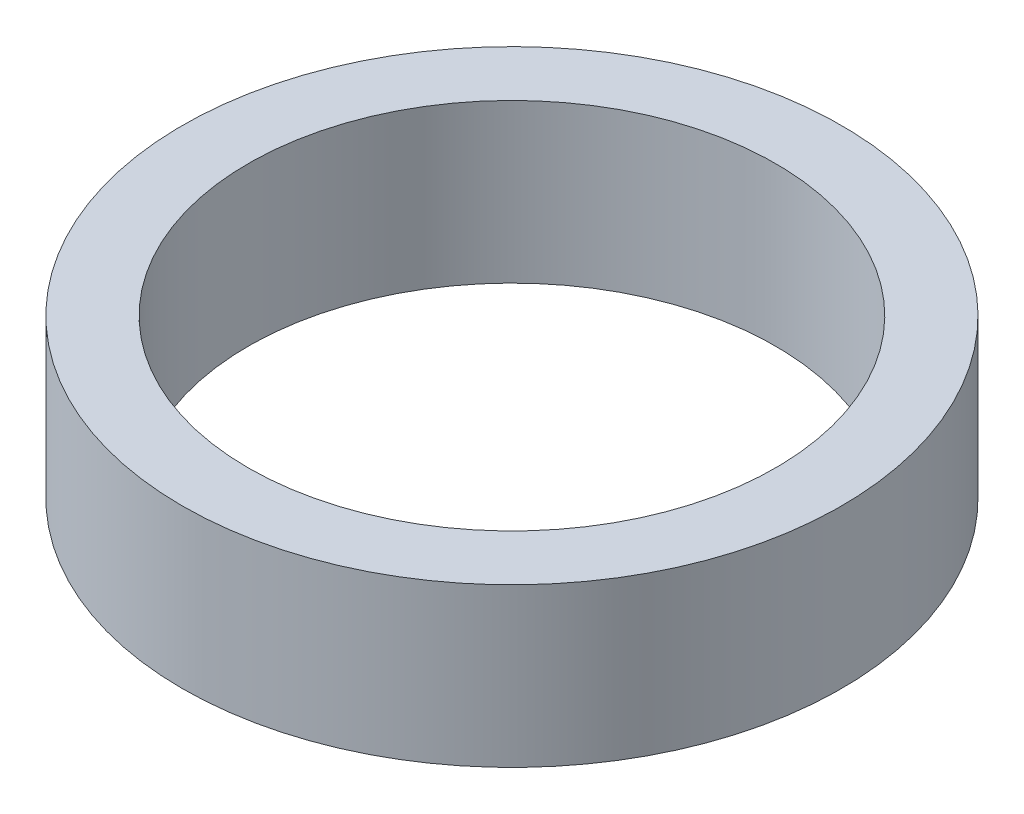
ISO-10303-21;
HEADER;
FILE_DESCRIPTION(('STEP AP214'),'2;1');
FILE_NAME('part.step','',(''),(''),'','','');
FILE_SCHEMA(('AUTOMOTIVE_DESIGN { 1 0 10303 214 1 1 1 1 }'));
ENDSEC;
DATA;
#1=APPLICATION_CONTEXT('core data for automotive mechanical design processes');
#2=APPLICATION_PROTOCOL_DEFINITION('international standard','automotive_design',2000,#1);
#3=PRODUCT_CONTEXT('',#1,'mechanical');
#4=PRODUCT('Part','Part','',(#3));
#5=PRODUCT_RELATED_PRODUCT_CATEGORY('part','',(#4));
#6=PRODUCT_DEFINITION_FORMATION('','',#4);
#7=PRODUCT_DEFINITION_CONTEXT('part definition',#1,'design');
#8=PRODUCT_DEFINITION('design','',#6,#7);
#9=PRODUCT_DEFINITION_SHAPE('','',#8);
#10=(LENGTH_UNIT() NAMED_UNIT(*) SI_UNIT(.MILLI.,.METRE.));
#11=(NAMED_UNIT(*) PLANE_ANGLE_UNIT() SI_UNIT($,.RADIAN.));
#12=(NAMED_UNIT(*) SI_UNIT($,.STERADIAN.) SOLID_ANGLE_UNIT());
#13=UNCERTAINTY_MEASURE_WITH_UNIT(LENGTH_MEASURE(1.E-05),#10,'distance_accuracy_value','');
#14=(GEOMETRIC_REPRESENTATION_CONTEXT(3) GLOBAL_UNCERTAINTY_ASSIGNED_CONTEXT((#13)) GLOBAL_UNIT_ASSIGNED_CONTEXT((#10,
#11,#12)) REPRESENTATION_CONTEXT('',''));
#15=CARTESIAN_POINT('',(0.,0.,0.));
#16=DIRECTION('',(0.,0.,1.));
#17=DIRECTION('',(1.,0.,0.));
#18=AXIS2_PLACEMENT_3D('',#15,#16,#17);
#19=CARTESIAN_POINT('',(0.,24.,0.));
#20=DIRECTION('',(0.,-1.,0.));
#21=DIRECTION('',(0.,0.,-1.));
#22=AXIS2_PLACEMENT_3D('',#19,#20,#21);
#23=CYLINDRICAL_SURFACE('',#22,50.);
#24=CARTESIAN_POINT('',(0.,24.,0.));
#25=DIRECTION('',(0.,1.,0.));
#26=DIRECTION('',(0.,0.,1.));
#27=AXIS2_PLACEMENT_3D('',#24,#25,#26);
#28=CIRCLE('',#27,50.);
#29=CARTESIAN_POINT('',(0.,24.,50.));
#30=VERTEX_POINT('',#29);
#31=EDGE_CURVE('E10',#30,#30,#28,.T.);
#32=ORIENTED_EDGE('',*,*,#31,.F.);
#33=EDGE_LOOP('',(#32));
#34=FACE_BOUND('',#33,.T.);
#35=CARTESIAN_POINT('',(0.,0.,0.));
#36=DIRECTION('',(0.,1.,0.));
#37=DIRECTION('',(0.,0.,1.));
#38=AXIS2_PLACEMENT_3D('',#35,#36,#37);
#39=CIRCLE('',#38,50.);
#40=CARTESIAN_POINT('',(0.,0.,50.));
#41=VERTEX_POINT('',#40);
#42=EDGE_CURVE('E37',#41,#41,#39,.T.);
#43=ORIENTED_EDGE('',*,*,#42,.T.);
#44=EDGE_LOOP('',(#43));
#45=FACE_BOUND('',#44,.T.);
#46=ADVANCED_FACE('F40',(#34,#45),#23,.T.);
#47=CARTESIAN_POINT('',(0.,24.,0.));
#48=DIRECTION('',(0.,1.,0.));
#49=DIRECTION('',(0.,0.,1.));
#50=AXIS2_PLACEMENT_3D('',#47,#48,#49);
#51=PLANE('',#50);
#52=CARTESIAN_POINT('',(0.,24.,0.));
#53=DIRECTION('',(0.,1.,0.));
#54=DIRECTION('',(0.,0.,1.));
#55=AXIS2_PLACEMENT_3D('',#52,#53,#54);
#56=CIRCLE('',#55,40.);
#57=CARTESIAN_POINT('',(0.,24.,40.));
#58=VERTEX_POINT('',#57);
#59=EDGE_CURVE('E50',#58,#58,#56,.T.);
#60=ORIENTED_EDGE('',*,*,#59,.F.);
#61=EDGE_LOOP('',(#60));
#62=FACE_BOUND('',#61,.T.);
#63=ORIENTED_EDGE('',*,*,#31,.T.);
#64=EDGE_LOOP('',(#63));
#65=FACE_BOUND('',#64,.T.);
#66=ADVANCED_FACE('F59',(#62,#65),#51,.T.);
#67=CARTESIAN_POINT('',(0.,0.,0.));
#68=DIRECTION('',(0.,1.,0.));
#69=DIRECTION('',(0.,0.,1.));
#70=AXIS2_PLACEMENT_3D('',#67,#68,#69);
#71=PLANE('',#70);
#72=CARTESIAN_POINT('',(0.,0.,0.));
#73=DIRECTION('',(0.,1.,0.));
#74=DIRECTION('',(0.,0.,1.));
#75=AXIS2_PLACEMENT_3D('',#72,#73,#74);
#76=CIRCLE('',#75,40.);
#77=CARTESIAN_POINT('',(0.,0.,40.));
#78=VERTEX_POINT('',#77);
#79=EDGE_CURVE('E47',#78,#78,#76,.T.);
#80=ORIENTED_EDGE('',*,*,#79,.T.);
#81=EDGE_LOOP('',(#80));
#82=FACE_BOUND('',#81,.T.);
#83=ORIENTED_EDGE('',*,*,#42,.F.);
#84=EDGE_LOOP('',(#83));
#85=FACE_BOUND('',#84,.T.);
#86=ADVANCED_FACE('F58',(#82,#85),#71,.F.);
#87=CARTESIAN_POINT('',(0.,24.,0.));
#88=DIRECTION('',(0.,-1.,0.));
#89=DIRECTION('',(0.,0.,-1.));
#90=AXIS2_PLACEMENT_3D('',#87,#88,#89);
#91=CYLINDRICAL_SURFACE('',#90,40.);
#92=ORIENTED_EDGE('',*,*,#59,.T.);
#93=EDGE_LOOP('',(#92));
#94=FACE_BOUND('',#93,.T.);
#95=ORIENTED_EDGE('',*,*,#79,.F.);
#96=EDGE_LOOP('',(#95));
#97=FACE_BOUND('',#96,.T.);
#98=ADVANCED_FACE('F54',(#94,#97),#91,.F.);
#99=CLOSED_SHELL('',(#46,#66,#86,#98));
#100=MANIFOLD_SOLID_BREP('B2',#99);
#101=ADVANCED_BREP_SHAPE_REPRESENTATION('',(#18,#100),#14);
#102=SHAPE_DEFINITION_REPRESENTATION(#9,#101);
ENDSEC;
END-ISO-10303-21;
